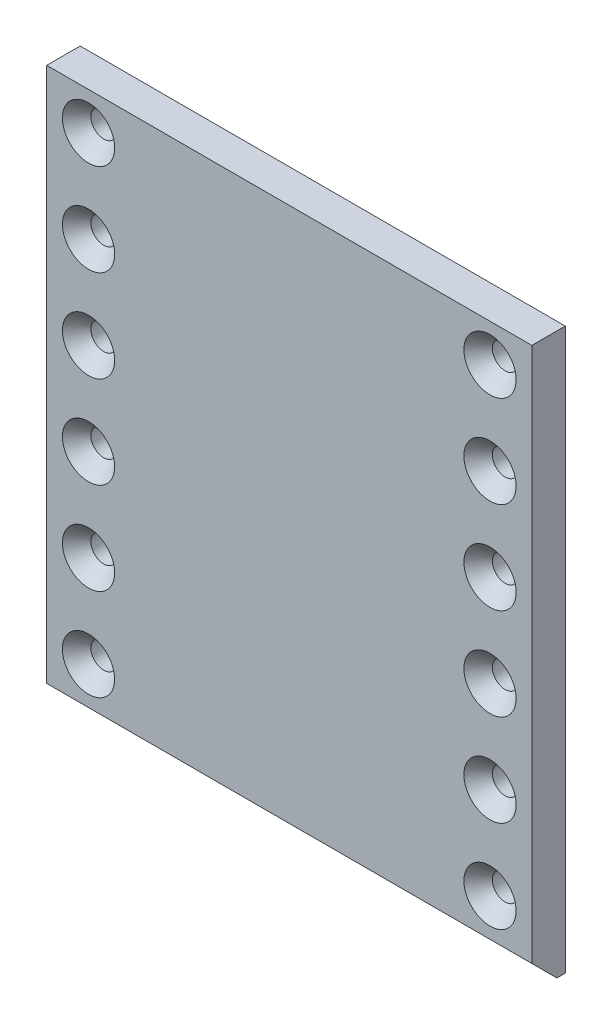
ISO-10303-21;
HEADER;
FILE_DESCRIPTION(('STEP AP214'),'2;1');
FILE_NAME('part.step','',(''),(''),'','','');
FILE_SCHEMA(('AUTOMOTIVE_DESIGN { 1 0 10303 214 1 1 1 1 }'));
ENDSEC;
DATA;
#1=APPLICATION_CONTEXT('core data for automotive mechanical design processes');
#2=APPLICATION_PROTOCOL_DEFINITION('international standard','automotive_design',2000,#1);
#3=PRODUCT_CONTEXT('',#1,'mechanical');
#4=PRODUCT('Part','Part','',(#3));
#5=PRODUCT_RELATED_PRODUCT_CATEGORY('part','',(#4));
#6=PRODUCT_DEFINITION_FORMATION('','',#4);
#7=PRODUCT_DEFINITION_CONTEXT('part definition',#1,'design');
#8=PRODUCT_DEFINITION('design','',#6,#7);
#9=PRODUCT_DEFINITION_SHAPE('','',#8);
#10=(LENGTH_UNIT() NAMED_UNIT(*) SI_UNIT(.MILLI.,.METRE.));
#11=(NAMED_UNIT(*) PLANE_ANGLE_UNIT() SI_UNIT($,.RADIAN.));
#12=(NAMED_UNIT(*) SI_UNIT($,.STERADIAN.) SOLID_ANGLE_UNIT());
#13=UNCERTAINTY_MEASURE_WITH_UNIT(LENGTH_MEASURE(1.E-05),#10,'distance_accuracy_value','');
#14=(GEOMETRIC_REPRESENTATION_CONTEXT(3) GLOBAL_UNCERTAINTY_ASSIGNED_CONTEXT((#13)) GLOBAL_UNIT_ASSIGNED_CONTEXT((#10,
#11,#12)) REPRESENTATION_CONTEXT('',''));
#15=CARTESIAN_POINT('',(0.,0.,0.));
#16=DIRECTION('',(0.,0.,1.));
#17=DIRECTION('',(1.,0.,0.));
#18=AXIS2_PLACEMENT_3D('',#15,#16,#17);
#19=CARTESIAN_POINT('',(92.075,106.3625,6.35));
#20=DIRECTION('',(-1.,0.,0.));
#21=DIRECTION('',(0.,-1.,0.));
#22=AXIS2_PLACEMENT_3D('',#19,#20,#21);
#23=PLANE('',#22);
#24=DIRECTION('',(0.,1.,0.));
#25=VECTOR('',#24,1.);
#26=CARTESIAN_POINT('',(92.075,106.3625,6.35));
#27=LINE('',#26,#25);
#28=CARTESIAN_POINT('',(92.075,-96.8375,6.35000000000001));
#29=VERTEX_POINT('',#28);
#30=CARTESIAN_POINT('',(92.075,106.3625,6.35));
#31=VERTEX_POINT('',#30);
#32=EDGE_CURVE('E76',#29,#31,#27,.T.);
#33=ORIENTED_EDGE('',*,*,#32,.F.);
#34=DIRECTION('',(0.,-0.707106781186547,-0.707106781186549));
#35=VECTOR('',#34,1.);
#36=CARTESIAN_POINT('',(92.075,-96.8375,6.35000000000001));
#37=LINE('',#36,#35);
#38=CARTESIAN_POINT('',(92.075,-106.3625,-3.17500000000006));
#39=VERTEX_POINT('',#38);
#40=EDGE_CURVE('E54',#29,#39,#37,.T.);
#41=ORIENTED_EDGE('',*,*,#40,.T.);
#42=DIRECTION('',(0.,0.,-1.));
#43=VECTOR('',#42,1.);
#44=CARTESIAN_POINT('',(92.075,-106.3625,6.35));
#45=LINE('',#44,#43);
#46=CARTESIAN_POINT('',(92.075,-106.3625,-6.35));
#47=VERTEX_POINT('',#46);
#48=EDGE_CURVE('E106',#39,#47,#45,.T.);
#49=ORIENTED_EDGE('',*,*,#48,.T.);
#50=DIRECTION('',(0.,1.,0.));
#51=VECTOR('',#50,1.);
#52=CARTESIAN_POINT('',(92.075,106.3625,-6.35));
#53=LINE('',#52,#51);
#54=CARTESIAN_POINT('',(92.075,106.3625,-6.35));
#55=VERTEX_POINT('',#54);
#56=EDGE_CURVE('E98',#47,#55,#53,.T.);
#57=ORIENTED_EDGE('',*,*,#56,.T.);
#58=DIRECTION('',(0.,0.,-1.));
#59=VECTOR('',#58,1.);
#60=CARTESIAN_POINT('',(92.075,106.3625,6.35));
#61=LINE('',#60,#59);
#62=EDGE_CURVE('E90',#31,#55,#61,.T.);
#63=ORIENTED_EDGE('',*,*,#62,.F.);
#64=EDGE_LOOP('',(#33,#41,#49,#57,#63));
#65=FACE_BOUND('',#64,.T.);
#66=ADVANCED_FACE('F32',(#65),#23,.F.);
#67=CARTESIAN_POINT('',(-92.075,106.3625,6.35));
#68=DIRECTION('',(0.,-1.,0.));
#69=DIRECTION('',(0.,0.,-1.));
#70=AXIS2_PLACEMENT_3D('',#67,#68,#69);
#71=PLANE('',#70);
#72=DIRECTION('',(-1.,0.,0.));
#73=VECTOR('',#72,1.);
#74=CARTESIAN_POINT('',(-92.075,106.3625,-6.35));
#75=LINE('',#74,#73);
#76=CARTESIAN_POINT('',(-92.075,106.3625,-6.35));
#77=VERTEX_POINT('',#76);
#78=EDGE_CURVE('E113',#55,#77,#75,.T.);
#79=ORIENTED_EDGE('',*,*,#78,.T.);
#80=DIRECTION('',(0.,0.,-1.));
#81=VECTOR('',#80,1.);
#82=CARTESIAN_POINT('',(-92.075,106.3625,6.35));
#83=LINE('',#82,#81);
#84=CARTESIAN_POINT('',(-92.075,106.3625,6.35));
#85=VERTEX_POINT('',#84);
#86=EDGE_CURVE('E93',#85,#77,#83,.T.);
#87=ORIENTED_EDGE('',*,*,#86,.F.);
#88=DIRECTION('',(-1.,0.,0.));
#89=VECTOR('',#88,1.);
#90=CARTESIAN_POINT('',(-92.075,106.3625,6.35));
#91=LINE('',#90,#89);
#92=EDGE_CURVE('E80',#31,#85,#91,.T.);
#93=ORIENTED_EDGE('',*,*,#92,.F.);
#94=ORIENTED_EDGE('',*,*,#62,.T.);
#95=EDGE_LOOP('',(#79,#87,#93,#94));
#96=FACE_BOUND('',#95,.T.);
#97=ADVANCED_FACE('F89',(#96),#71,.F.);
#98=CARTESIAN_POINT('',(-92.075,106.3625,6.35));
#99=DIRECTION('',(1.,0.,0.));
#100=DIRECTION('',(0.,1.,0.));
#101=AXIS2_PLACEMENT_3D('',#98,#99,#100);
#102=PLANE('',#101);
#103=DIRECTION('',(0.,0.,-1.));
#104=VECTOR('',#103,1.);
#105=CARTESIAN_POINT('',(-92.075,-106.3625,6.35));
#106=LINE('',#105,#104);
#107=CARTESIAN_POINT('',(-92.075,-106.3625,-3.17500000000007));
#108=VERTEX_POINT('',#107);
#109=CARTESIAN_POINT('',(-92.075,-106.3625,-6.35));
#110=VERTEX_POINT('',#109);
#111=EDGE_CURVE('E101',#108,#110,#106,.T.);
#112=ORIENTED_EDGE('',*,*,#111,.F.);
#113=DIRECTION('',(0.,0.707106781186547,0.707106781186549));
#114=VECTOR('',#113,1.);
#115=CARTESIAN_POINT('',(-92.075,-96.8375,6.34999999999999));
#116=LINE('',#115,#114);
#117=CARTESIAN_POINT('',(-92.075,-96.8375,6.35));
#118=VERTEX_POINT('',#117);
#119=EDGE_CURVE('E11',#108,#118,#116,.T.);
#120=ORIENTED_EDGE('',*,*,#119,.T.);
#121=DIRECTION('',(0.,-1.,0.));
#122=VECTOR('',#121,1.);
#123=CARTESIAN_POINT('',(-92.075,106.3625,6.35));
#124=LINE('',#123,#122);
#125=EDGE_CURVE('E95',#85,#118,#124,.T.);
#126=ORIENTED_EDGE('',*,*,#125,.F.);
#127=ORIENTED_EDGE('',*,*,#86,.T.);
#128=DIRECTION('',(0.,-1.,0.));
#129=VECTOR('',#128,1.);
#130=CARTESIAN_POINT('',(-92.075,106.3625,-6.35));
#131=LINE('',#130,#129);
#132=EDGE_CURVE('E110',#77,#110,#131,.T.);
#133=ORIENTED_EDGE('',*,*,#132,.T.);
#134=EDGE_LOOP('',(#112,#120,#126,#127,#133));
#135=FACE_BOUND('',#134,.T.);
#136=ADVANCED_FACE('F275',(#135),#102,.F.);
#137=CARTESIAN_POINT('',(-92.075,-106.3625,6.35));
#138=DIRECTION('',(0.,1.,0.));
#139=DIRECTION('',(0.,0.,1.));
#140=AXIS2_PLACEMENT_3D('',#137,#138,#139);
#141=PLANE('',#140);
#142=ORIENTED_EDGE('',*,*,#48,.F.);
#143=DIRECTION('',(-1.,0.,0.));
#144=VECTOR('',#143,1.);
#145=CARTESIAN_POINT('',(-92.075,-106.3625,-3.17500000000006));
#146=LINE('',#145,#144);
#147=EDGE_CURVE('E40',#39,#108,#146,.T.);
#148=ORIENTED_EDGE('',*,*,#147,.T.);
#149=ORIENTED_EDGE('',*,*,#111,.T.);
#150=DIRECTION('',(1.,0.,0.));
#151=VECTOR('',#150,1.);
#152=CARTESIAN_POINT('',(-92.075,-106.3625,-6.35));
#153=LINE('',#152,#151);
#154=EDGE_CURVE('E85',#110,#47,#153,.T.);
#155=ORIENTED_EDGE('',*,*,#154,.T.);
#156=EDGE_LOOP('',(#142,#148,#149,#155));
#157=FACE_BOUND('',#156,.T.);
#158=ADVANCED_FACE('F231',(#157),#141,.F.);
#159=CARTESIAN_POINT('',(0.,0.,6.35));
#160=DIRECTION('',(0.,0.,1.));
#161=DIRECTION('',(1.,0.,0.));
#162=AXIS2_PLACEMENT_3D('',#159,#160,#161);
#163=PLANE('',#162);
#164=CARTESIAN_POINT('',(-76.2,92.075,6.35));
#165=DIRECTION('',(0.,0.,1.));
#166=DIRECTION('',(1.,0.,0.));
#167=AXIS2_PLACEMENT_3D('',#164,#165,#166);
#168=CIRCLE('',#167,9.9187);
#169=CARTESIAN_POINT('',(-66.2813,92.075,6.35));
#170=VERTEX_POINT('',#169);
#171=EDGE_CURVE('E222',#170,#170,#168,.T.);
#172=ORIENTED_EDGE('',*,*,#171,.F.);
#173=EDGE_LOOP('',(#172));
#174=FACE_BOUND('',#173,.T.);
#175=CARTESIAN_POINT('',(-76.2,57.15,6.35));
#176=DIRECTION('',(0.,0.,1.));
#177=DIRECTION('',(1.,0.,0.));
#178=AXIS2_PLACEMENT_3D('',#175,#176,#177);
#179=CIRCLE('',#178,9.9187);
#180=CARTESIAN_POINT('',(-66.2813,57.15,6.35));
#181=VERTEX_POINT('',#180);
#182=EDGE_CURVE('E213',#181,#181,#179,.T.);
#183=ORIENTED_EDGE('',*,*,#182,.F.);
#184=EDGE_LOOP('',(#183));
#185=FACE_BOUND('',#184,.T.);
#186=CARTESIAN_POINT('',(-76.2,22.225,6.35));
#187=DIRECTION('',(0.,0.,1.));
#188=DIRECTION('',(1.,0.,0.));
#189=AXIS2_PLACEMENT_3D('',#186,#187,#188);
#190=CIRCLE('',#189,9.9187);
#191=CARTESIAN_POINT('',(-66.2813,22.225,6.35));
#192=VERTEX_POINT('',#191);
#193=EDGE_CURVE('E204',#192,#192,#190,.T.);
#194=ORIENTED_EDGE('',*,*,#193,.F.);
#195=EDGE_LOOP('',(#194));
#196=FACE_BOUND('',#195,.T.);
#197=CARTESIAN_POINT('',(-76.2,-12.7,6.35));
#198=DIRECTION('',(0.,0.,1.));
#199=DIRECTION('',(1.,0.,0.));
#200=AXIS2_PLACEMENT_3D('',#197,#198,#199);
#201=CIRCLE('',#200,9.9187);
#202=CARTESIAN_POINT('',(-66.2813,-12.7,6.35));
#203=VERTEX_POINT('',#202);
#204=EDGE_CURVE('E195',#203,#203,#201,.T.);
#205=ORIENTED_EDGE('',*,*,#204,.F.);
#206=EDGE_LOOP('',(#205));
#207=FACE_BOUND('',#206,.T.);
#208=CARTESIAN_POINT('',(-76.2,-47.625,6.35));
#209=DIRECTION('',(0.,0.,1.));
#210=DIRECTION('',(1.,0.,0.));
#211=AXIS2_PLACEMENT_3D('',#208,#209,#210);
#212=CIRCLE('',#211,9.9187);
#213=CARTESIAN_POINT('',(-66.2813,-47.625,6.35));
#214=VERTEX_POINT('',#213);
#215=EDGE_CURVE('E186',#214,#214,#212,.T.);
#216=ORIENTED_EDGE('',*,*,#215,.F.);
#217=EDGE_LOOP('',(#216));
#218=FACE_BOUND('',#217,.T.);
#219=CARTESIAN_POINT('',(-76.2,-82.55,6.35));
#220=DIRECTION('',(0.,0.,1.));
#221=DIRECTION('',(1.,0.,0.));
#222=AXIS2_PLACEMENT_3D('',#219,#220,#221);
#223=CIRCLE('',#222,9.9187);
#224=CARTESIAN_POINT('',(-66.2813,-82.55,6.35));
#225=VERTEX_POINT('',#224);
#226=EDGE_CURVE('E177',#225,#225,#223,.T.);
#227=ORIENTED_EDGE('',*,*,#226,.F.);
#228=EDGE_LOOP('',(#227));
#229=FACE_BOUND('',#228,.T.);
#230=CARTESIAN_POINT('',(76.2,-82.55,6.35));
#231=DIRECTION('',(0.,0.,1.));
#232=DIRECTION('',(1.,0.,0.));
#233=AXIS2_PLACEMENT_3D('',#230,#231,#232);
#234=CIRCLE('',#233,9.9187);
#235=CARTESIAN_POINT('',(86.1187,-82.55,6.35));
#236=VERTEX_POINT('',#235);
#237=EDGE_CURVE('E168',#236,#236,#234,.T.);
#238=ORIENTED_EDGE('',*,*,#237,.F.);
#239=EDGE_LOOP('',(#238));
#240=FACE_BOUND('',#239,.T.);
#241=CARTESIAN_POINT('',(76.2,-47.625,6.35));
#242=DIRECTION('',(0.,0.,1.));
#243=DIRECTION('',(1.,0.,0.));
#244=AXIS2_PLACEMENT_3D('',#241,#242,#243);
#245=CIRCLE('',#244,9.9187);
#246=CARTESIAN_POINT('',(86.1187,-47.625,6.35));
#247=VERTEX_POINT('',#246);
#248=EDGE_CURVE('E159',#247,#247,#245,.T.);
#249=ORIENTED_EDGE('',*,*,#248,.F.);
#250=EDGE_LOOP('',(#249));
#251=FACE_BOUND('',#250,.T.);
#252=CARTESIAN_POINT('',(76.2,-12.7,6.35));
#253=DIRECTION('',(0.,0.,1.));
#254=DIRECTION('',(1.,0.,0.));
#255=AXIS2_PLACEMENT_3D('',#252,#253,#254);
#256=CIRCLE('',#255,9.9187);
#257=CARTESIAN_POINT('',(86.1187,-12.7,6.35));
#258=VERTEX_POINT('',#257);
#259=EDGE_CURVE('E150',#258,#258,#256,.T.);
#260=ORIENTED_EDGE('',*,*,#259,.F.);
#261=EDGE_LOOP('',(#260));
#262=FACE_BOUND('',#261,.T.);
#263=CARTESIAN_POINT('',(76.2,22.225,6.35));
#264=DIRECTION('',(0.,0.,1.));
#265=DIRECTION('',(1.,0.,0.));
#266=AXIS2_PLACEMENT_3D('',#263,#264,#265);
#267=CIRCLE('',#266,9.9187);
#268=CARTESIAN_POINT('',(86.1187,22.225,6.35));
#269=VERTEX_POINT('',#268);
#270=EDGE_CURVE('E141',#269,#269,#267,.T.);
#271=ORIENTED_EDGE('',*,*,#270,.F.);
#272=EDGE_LOOP('',(#271));
#273=FACE_BOUND('',#272,.T.);
#274=CARTESIAN_POINT('',(76.2,57.15,6.35));
#275=DIRECTION('',(0.,0.,1.));
#276=DIRECTION('',(1.,0.,0.));
#277=AXIS2_PLACEMENT_3D('',#274,#275,#276);
#278=CIRCLE('',#277,9.9187);
#279=CARTESIAN_POINT('',(86.1187,57.15,6.35));
#280=VERTEX_POINT('',#279);
#281=EDGE_CURVE('E132',#280,#280,#278,.T.);
#282=ORIENTED_EDGE('',*,*,#281,.F.);
#283=EDGE_LOOP('',(#282));
#284=FACE_BOUND('',#283,.T.);
#285=CARTESIAN_POINT('',(76.2,92.075,6.35));
#286=DIRECTION('',(0.,0.,1.));
#287=DIRECTION('',(1.,0.,0.));
#288=AXIS2_PLACEMENT_3D('',#285,#286,#287);
#289=CIRCLE('',#288,9.9187);
#290=CARTESIAN_POINT('',(86.1187,92.075,6.35));
#291=VERTEX_POINT('',#290);
#292=EDGE_CURVE('E123',#291,#291,#289,.T.);
#293=ORIENTED_EDGE('',*,*,#292,.F.);
#294=EDGE_LOOP('',(#293));
#295=FACE_BOUND('',#294,.T.);
#296=ORIENTED_EDGE('',*,*,#125,.T.);
#297=DIRECTION('',(1.,0.,0.));
#298=VECTOR('',#297,1.);
#299=CARTESIAN_POINT('',(92.075,-96.8375,6.35));
#300=LINE('',#299,#298);
#301=EDGE_CURVE('E83',#118,#29,#300,.T.);
#302=ORIENTED_EDGE('',*,*,#301,.T.);
#303=ORIENTED_EDGE('',*,*,#32,.T.);
#304=ORIENTED_EDGE('',*,*,#92,.T.);
#305=EDGE_LOOP('',(#296,#302,#303,#304));
#306=FACE_BOUND('',#305,.T.);
#307=ADVANCED_FACE('F79',(#174,#185,#196,#207,#218,#229,#240,#251,#262,#273,#284,#295,#306),
#163,.T.);
#308=CARTESIAN_POINT('',(0.,0.,-6.35));
#309=DIRECTION('',(0.,0.,1.));
#310=DIRECTION('',(1.,0.,0.));
#311=AXIS2_PLACEMENT_3D('',#308,#309,#310);
#312=PLANE('',#311);
#313=CARTESIAN_POINT('',(-76.2,92.075,-6.35));
#314=DIRECTION('',(0.,0.,1.));
#315=DIRECTION('',(1.,0.,0.));
#316=AXIS2_PLACEMENT_3D('',#313,#314,#315);
#317=CIRCLE('',#316,4.9022);
#318=CARTESIAN_POINT('',(-71.2978,92.075,-6.35));
#319=VERTEX_POINT('',#318);
#320=EDGE_CURVE('E216',#319,#319,#317,.T.);
#321=ORIENTED_EDGE('',*,*,#320,.T.);
#322=EDGE_LOOP('',(#321));
#323=FACE_BOUND('',#322,.T.);
#324=CARTESIAN_POINT('',(-76.2,57.15,-6.35));
#325=DIRECTION('',(0.,0.,1.));
#326=DIRECTION('',(1.,0.,0.));
#327=AXIS2_PLACEMENT_3D('',#324,#325,#326);
#328=CIRCLE('',#327,4.9022);
#329=CARTESIAN_POINT('',(-71.2978,57.15,-6.35));
#330=VERTEX_POINT('',#329);
#331=EDGE_CURVE('E207',#330,#330,#328,.T.);
#332=ORIENTED_EDGE('',*,*,#331,.T.);
#333=EDGE_LOOP('',(#332));
#334=FACE_BOUND('',#333,.T.);
#335=CARTESIAN_POINT('',(-76.2,22.225,-6.35));
#336=DIRECTION('',(0.,0.,1.));
#337=DIRECTION('',(1.,0.,0.));
#338=AXIS2_PLACEMENT_3D('',#335,#336,#337);
#339=CIRCLE('',#338,4.9022);
#340=CARTESIAN_POINT('',(-71.2978,22.225,-6.35));
#341=VERTEX_POINT('',#340);
#342=EDGE_CURVE('E198',#341,#341,#339,.T.);
#343=ORIENTED_EDGE('',*,*,#342,.T.);
#344=EDGE_LOOP('',(#343));
#345=FACE_BOUND('',#344,.T.);
#346=CARTESIAN_POINT('',(-76.2,-12.7,-6.35));
#347=DIRECTION('',(0.,0.,1.));
#348=DIRECTION('',(1.,0.,0.));
#349=AXIS2_PLACEMENT_3D('',#346,#347,#348);
#350=CIRCLE('',#349,4.9022);
#351=CARTESIAN_POINT('',(-71.2978,-12.7,-6.35));
#352=VERTEX_POINT('',#351);
#353=EDGE_CURVE('E189',#352,#352,#350,.T.);
#354=ORIENTED_EDGE('',*,*,#353,.T.);
#355=EDGE_LOOP('',(#354));
#356=FACE_BOUND('',#355,.T.);
#357=CARTESIAN_POINT('',(-76.2,-47.625,-6.35));
#358=DIRECTION('',(0.,0.,1.));
#359=DIRECTION('',(1.,0.,0.));
#360=AXIS2_PLACEMENT_3D('',#357,#358,#359);
#361=CIRCLE('',#360,4.9022);
#362=CARTESIAN_POINT('',(-71.2978,-47.625,-6.35));
#363=VERTEX_POINT('',#362);
#364=EDGE_CURVE('E180',#363,#363,#361,.T.);
#365=ORIENTED_EDGE('',*,*,#364,.T.);
#366=EDGE_LOOP('',(#365));
#367=FACE_BOUND('',#366,.T.);
#368=CARTESIAN_POINT('',(-76.2,-82.55,-6.35));
#369=DIRECTION('',(0.,0.,1.));
#370=DIRECTION('',(1.,0.,0.));
#371=AXIS2_PLACEMENT_3D('',#368,#369,#370);
#372=CIRCLE('',#371,4.9022);
#373=CARTESIAN_POINT('',(-71.2978,-82.55,-6.35));
#374=VERTEX_POINT('',#373);
#375=EDGE_CURVE('E171',#374,#374,#372,.T.);
#376=ORIENTED_EDGE('',*,*,#375,.T.);
#377=EDGE_LOOP('',(#376));
#378=FACE_BOUND('',#377,.T.);
#379=CARTESIAN_POINT('',(76.2,-82.55,-6.35));
#380=DIRECTION('',(0.,0.,1.));
#381=DIRECTION('',(1.,0.,0.));
#382=AXIS2_PLACEMENT_3D('',#379,#380,#381);
#383=CIRCLE('',#382,4.9022);
#384=CARTESIAN_POINT('',(81.1022,-82.55,-6.35));
#385=VERTEX_POINT('',#384);
#386=EDGE_CURVE('E162',#385,#385,#383,.T.);
#387=ORIENTED_EDGE('',*,*,#386,.T.);
#388=EDGE_LOOP('',(#387));
#389=FACE_BOUND('',#388,.T.);
#390=CARTESIAN_POINT('',(76.2,-47.625,-6.35));
#391=DIRECTION('',(0.,0.,1.));
#392=DIRECTION('',(1.,0.,0.));
#393=AXIS2_PLACEMENT_3D('',#390,#391,#392);
#394=CIRCLE('',#393,4.9022);
#395=CARTESIAN_POINT('',(81.1022,-47.625,-6.35));
#396=VERTEX_POINT('',#395);
#397=EDGE_CURVE('E153',#396,#396,#394,.T.);
#398=ORIENTED_EDGE('',*,*,#397,.T.);
#399=EDGE_LOOP('',(#398));
#400=FACE_BOUND('',#399,.T.);
#401=CARTESIAN_POINT('',(76.2,-12.7,-6.35));
#402=DIRECTION('',(0.,0.,1.));
#403=DIRECTION('',(1.,0.,0.));
#404=AXIS2_PLACEMENT_3D('',#401,#402,#403);
#405=CIRCLE('',#404,4.9022);
#406=CARTESIAN_POINT('',(81.1022,-12.7,-6.35));
#407=VERTEX_POINT('',#406);
#408=EDGE_CURVE('E144',#407,#407,#405,.T.);
#409=ORIENTED_EDGE('',*,*,#408,.T.);
#410=EDGE_LOOP('',(#409));
#411=FACE_BOUND('',#410,.T.);
#412=CARTESIAN_POINT('',(76.2,22.225,-6.35));
#413=DIRECTION('',(0.,0.,1.));
#414=DIRECTION('',(1.,0.,0.));
#415=AXIS2_PLACEMENT_3D('',#412,#413,#414);
#416=CIRCLE('',#415,4.9022);
#417=CARTESIAN_POINT('',(81.1022,22.225,-6.35));
#418=VERTEX_POINT('',#417);
#419=EDGE_CURVE('E135',#418,#418,#416,.T.);
#420=ORIENTED_EDGE('',*,*,#419,.T.);
#421=EDGE_LOOP('',(#420));
#422=FACE_BOUND('',#421,.T.);
#423=CARTESIAN_POINT('',(76.2,57.15,-6.35));
#424=DIRECTION('',(0.,0.,1.));
#425=DIRECTION('',(1.,0.,0.));
#426=AXIS2_PLACEMENT_3D('',#423,#424,#425);
#427=CIRCLE('',#426,4.9022);
#428=CARTESIAN_POINT('',(81.1022,57.15,-6.35));
#429=VERTEX_POINT('',#428);
#430=EDGE_CURVE('E126',#429,#429,#427,.T.);
#431=ORIENTED_EDGE('',*,*,#430,.T.);
#432=EDGE_LOOP('',(#431));
#433=FACE_BOUND('',#432,.T.);
#434=CARTESIAN_POINT('',(76.2,92.075,-6.35));
#435=DIRECTION('',(0.,0.,1.));
#436=DIRECTION('',(1.,0.,0.));
#437=AXIS2_PLACEMENT_3D('',#434,#435,#436);
#438=CIRCLE('',#437,4.9022);
#439=CARTESIAN_POINT('',(81.1022,92.075,-6.35));
#440=VERTEX_POINT('',#439);
#441=EDGE_CURVE('E116',#440,#440,#438,.T.);
#442=ORIENTED_EDGE('',*,*,#441,.T.);
#443=EDGE_LOOP('',(#442));
#444=FACE_BOUND('',#443,.T.);
#445=ORIENTED_EDGE('',*,*,#56,.F.);
#446=ORIENTED_EDGE('',*,*,#154,.F.);
#447=ORIENTED_EDGE('',*,*,#132,.F.);
#448=ORIENTED_EDGE('',*,*,#78,.F.);
#449=EDGE_LOOP('',(#445,#446,#447,#448));
#450=FACE_BOUND('',#449,.T.);
#451=ADVANCED_FACE('F230',(#323,#334,#345,#356,#367,#378,#389,#400,#411,#422,#433,#444,#450),
#312,.F.);
#452=CARTESIAN_POINT('',(76.2,92.075,6.35));
#453=DIRECTION('',(0.,0.,1.));
#454=DIRECTION('',(1.,0.,0.));
#455=AXIS2_PLACEMENT_3D('',#452,#453,#454);
#456=CYLINDRICAL_SURFACE('',#455,4.9022);
#457=ORIENTED_EDGE('',*,*,#441,.F.);
#458=EDGE_LOOP('',(#457));
#459=FACE_BOUND('',#458,.T.);
#460=CARTESIAN_POINT('',(76.2,92.075,0.579176885175799));
#461=DIRECTION('',(0.,0.,1.));
#462=DIRECTION('',(1.,0.,0.));
#463=AXIS2_PLACEMENT_3D('',#460,#461,#462);
#464=CIRCLE('',#463,4.9022);
#465=CARTESIAN_POINT('',(81.1022,92.075,0.579176885175799));
#466=VERTEX_POINT('',#465);
#467=EDGE_CURVE('E120',#466,#466,#464,.T.);
#468=ORIENTED_EDGE('',*,*,#467,.T.);
#469=EDGE_LOOP('',(#468));
#470=FACE_BOUND('',#469,.T.);
#471=ADVANCED_FACE('F258',(#459,#470),#456,.F.);
#472=CARTESIAN_POINT('',(76.2,92.075,6.35));
#473=DIRECTION('',(0.,0.,1.));
#474=DIRECTION('',(1.,0.,0.));
#475=AXIS2_PLACEMENT_3D('',#472,#473,#474);
#476=CONICAL_SURFACE('',#475,9.9187,0.715584993317675);
#477=ORIENTED_EDGE('',*,*,#467,.F.);
#478=EDGE_LOOP('',(#477));
#479=FACE_BOUND('',#478,.T.);
#480=ORIENTED_EDGE('',*,*,#292,.T.);
#481=EDGE_LOOP('',(#480));
#482=FACE_BOUND('',#481,.T.);
#483=ADVANCED_FACE('F255',(#479,#482),#476,.F.);
#484=CARTESIAN_POINT('',(76.2,57.15,6.35));
#485=DIRECTION('',(0.,0.,1.));
#486=DIRECTION('',(1.,0.,0.));
#487=AXIS2_PLACEMENT_3D('',#484,#485,#486);
#488=CYLINDRICAL_SURFACE('',#487,4.9022);
#489=ORIENTED_EDGE('',*,*,#430,.F.);
#490=EDGE_LOOP('',(#489));
#491=FACE_BOUND('',#490,.T.);
#492=CARTESIAN_POINT('',(76.2,57.15,0.579176885175799));
#493=DIRECTION('',(0.,0.,1.));
#494=DIRECTION('',(1.,0.,0.));
#495=AXIS2_PLACEMENT_3D('',#492,#493,#494);
#496=CIRCLE('',#495,4.9022);
#497=CARTESIAN_POINT('',(81.1022,57.15,0.579176885175799));
#498=VERTEX_POINT('',#497);
#499=EDGE_CURVE('E129',#498,#498,#496,.T.);
#500=ORIENTED_EDGE('',*,*,#499,.T.);
#501=EDGE_LOOP('',(#500));
#502=FACE_BOUND('',#501,.T.);
#503=ADVANCED_FACE('F257',(#491,#502),#488,.F.);
#504=CARTESIAN_POINT('',(76.2,57.15,6.35));
#505=DIRECTION('',(0.,0.,1.));
#506=DIRECTION('',(1.,0.,0.));
#507=AXIS2_PLACEMENT_3D('',#504,#505,#506);
#508=CONICAL_SURFACE('',#507,9.9187,0.715584993317675);
#509=ORIENTED_EDGE('',*,*,#499,.F.);
#510=EDGE_LOOP('',(#509));
#511=FACE_BOUND('',#510,.T.);
#512=ORIENTED_EDGE('',*,*,#281,.T.);
#513=EDGE_LOOP('',(#512));
#514=FACE_BOUND('',#513,.T.);
#515=ADVANCED_FACE('F265',(#511,#514),#508,.F.);
#516=CARTESIAN_POINT('',(76.2,22.225,6.35));
#517=DIRECTION('',(0.,0.,1.));
#518=DIRECTION('',(1.,0.,0.));
#519=AXIS2_PLACEMENT_3D('',#516,#517,#518);
#520=CYLINDRICAL_SURFACE('',#519,4.9022);
#521=ORIENTED_EDGE('',*,*,#419,.F.);
#522=EDGE_LOOP('',(#521));
#523=FACE_BOUND('',#522,.T.);
#524=CARTESIAN_POINT('',(76.2,22.225,0.579176885175799));
#525=DIRECTION('',(0.,0.,1.));
#526=DIRECTION('',(1.,0.,0.));
#527=AXIS2_PLACEMENT_3D('',#524,#525,#526);
#528=CIRCLE('',#527,4.9022);
#529=CARTESIAN_POINT('',(81.1022,22.225,0.579176885175799));
#530=VERTEX_POINT('',#529);
#531=EDGE_CURVE('E138',#530,#530,#528,.T.);
#532=ORIENTED_EDGE('',*,*,#531,.T.);
#533=EDGE_LOOP('',(#532));
#534=FACE_BOUND('',#533,.T.);
#535=ADVANCED_FACE('F396',(#523,#534),#520,.F.);
#536=CARTESIAN_POINT('',(76.2,22.225,6.35));
#537=DIRECTION('',(0.,0.,1.));
#538=DIRECTION('',(1.,0.,0.));
#539=AXIS2_PLACEMENT_3D('',#536,#537,#538);
#540=CONICAL_SURFACE('',#539,9.9187,0.715584993317675);
#541=ORIENTED_EDGE('',*,*,#531,.F.);
#542=EDGE_LOOP('',(#541));
#543=FACE_BOUND('',#542,.T.);
#544=ORIENTED_EDGE('',*,*,#270,.T.);
#545=EDGE_LOOP('',(#544));
#546=FACE_BOUND('',#545,.T.);
#547=ADVANCED_FACE('F392',(#543,#546),#540,.F.);
#548=CARTESIAN_POINT('',(76.2,-12.7,6.35));
#549=DIRECTION('',(0.,0.,1.));
#550=DIRECTION('',(1.,0.,0.));
#551=AXIS2_PLACEMENT_3D('',#548,#549,#550);
#552=CYLINDRICAL_SURFACE('',#551,4.9022);
#553=ORIENTED_EDGE('',*,*,#408,.F.);
#554=EDGE_LOOP('',(#553));
#555=FACE_BOUND('',#554,.T.);
#556=CARTESIAN_POINT('',(76.2,-12.7,0.579176885175799));
#557=DIRECTION('',(0.,0.,1.));
#558=DIRECTION('',(1.,0.,0.));
#559=AXIS2_PLACEMENT_3D('',#556,#557,#558);
#560=CIRCLE('',#559,4.9022);
#561=CARTESIAN_POINT('',(81.1022,-12.7,0.579176885175799));
#562=VERTEX_POINT('',#561);
#563=EDGE_CURVE('E147',#562,#562,#560,.T.);
#564=ORIENTED_EDGE('',*,*,#563,.T.);
#565=EDGE_LOOP('',(#564));
#566=FACE_BOUND('',#565,.T.);
#567=ADVANCED_FACE('F388',(#555,#566),#552,.F.);
#568=CARTESIAN_POINT('',(76.2,-12.7,6.35));
#569=DIRECTION('',(0.,0.,1.));
#570=DIRECTION('',(1.,0.,0.));
#571=AXIS2_PLACEMENT_3D('',#568,#569,#570);
#572=CONICAL_SURFACE('',#571,9.9187,0.715584993317675);
#573=ORIENTED_EDGE('',*,*,#563,.F.);
#574=EDGE_LOOP('',(#573));
#575=FACE_BOUND('',#574,.T.);
#576=ORIENTED_EDGE('',*,*,#259,.T.);
#577=EDGE_LOOP('',(#576));
#578=FACE_BOUND('',#577,.T.);
#579=ADVANCED_FACE('F384',(#575,#578),#572,.F.);
#580=CARTESIAN_POINT('',(76.2,-47.625,6.35));
#581=DIRECTION('',(0.,0.,1.));
#582=DIRECTION('',(1.,0.,0.));
#583=AXIS2_PLACEMENT_3D('',#580,#581,#582);
#584=CYLINDRICAL_SURFACE('',#583,4.9022);
#585=ORIENTED_EDGE('',*,*,#397,.F.);
#586=EDGE_LOOP('',(#585));
#587=FACE_BOUND('',#586,.T.);
#588=CARTESIAN_POINT('',(76.2,-47.625,0.579176885175799));
#589=DIRECTION('',(0.,0.,1.));
#590=DIRECTION('',(1.,0.,0.));
#591=AXIS2_PLACEMENT_3D('',#588,#589,#590);
#592=CIRCLE('',#591,4.9022);
#593=CARTESIAN_POINT('',(81.1022,-47.625,0.579176885175799));
#594=VERTEX_POINT('',#593);
#595=EDGE_CURVE('E156',#594,#594,#592,.T.);
#596=ORIENTED_EDGE('',*,*,#595,.T.);
#597=EDGE_LOOP('',(#596));
#598=FACE_BOUND('',#597,.T.);
#599=ADVANCED_FACE('F380',(#587,#598),#584,.F.);
#600=CARTESIAN_POINT('',(76.2,-47.625,6.35));
#601=DIRECTION('',(0.,0.,1.));
#602=DIRECTION('',(1.,0.,0.));
#603=AXIS2_PLACEMENT_3D('',#600,#601,#602);
#604=CONICAL_SURFACE('',#603,9.9187,0.715584993317675);
#605=ORIENTED_EDGE('',*,*,#595,.F.);
#606=EDGE_LOOP('',(#605));
#607=FACE_BOUND('',#606,.T.);
#608=ORIENTED_EDGE('',*,*,#248,.T.);
#609=EDGE_LOOP('',(#608));
#610=FACE_BOUND('',#609,.T.);
#611=ADVANCED_FACE('F376',(#607,#610),#604,.F.);
#612=CARTESIAN_POINT('',(76.2,-82.55,6.35));
#613=DIRECTION('',(0.,0.,1.));
#614=DIRECTION('',(1.,0.,0.));
#615=AXIS2_PLACEMENT_3D('',#612,#613,#614);
#616=CYLINDRICAL_SURFACE('',#615,4.9022);
#617=ORIENTED_EDGE('',*,*,#386,.F.);
#618=EDGE_LOOP('',(#617));
#619=FACE_BOUND('',#618,.T.);
#620=CARTESIAN_POINT('',(76.2,-82.55,0.579176885175799));
#621=DIRECTION('',(0.,0.,1.));
#622=DIRECTION('',(1.,0.,0.));
#623=AXIS2_PLACEMENT_3D('',#620,#621,#622);
#624=CIRCLE('',#623,4.9022);
#625=CARTESIAN_POINT('',(81.1022,-82.55,0.579176885175799));
#626=VERTEX_POINT('',#625);
#627=EDGE_CURVE('E165',#626,#626,#624,.T.);
#628=ORIENTED_EDGE('',*,*,#627,.T.);
#629=EDGE_LOOP('',(#628));
#630=FACE_BOUND('',#629,.T.);
#631=ADVANCED_FACE('F372',(#619,#630),#616,.F.);
#632=CARTESIAN_POINT('',(76.2,-82.55,6.35));
#633=DIRECTION('',(0.,0.,1.));
#634=DIRECTION('',(1.,0.,0.));
#635=AXIS2_PLACEMENT_3D('',#632,#633,#634);
#636=CONICAL_SURFACE('',#635,9.9187,0.715584993317675);
#637=ORIENTED_EDGE('',*,*,#627,.F.);
#638=EDGE_LOOP('',(#637));
#639=FACE_BOUND('',#638,.T.);
#640=ORIENTED_EDGE('',*,*,#237,.T.);
#641=EDGE_LOOP('',(#640));
#642=FACE_BOUND('',#641,.T.);
#643=ADVANCED_FACE('F368',(#639,#642),#636,.F.);
#644=CARTESIAN_POINT('',(-76.2,-82.55,6.35));
#645=DIRECTION('',(0.,0.,1.));
#646=DIRECTION('',(1.,0.,0.));
#647=AXIS2_PLACEMENT_3D('',#644,#645,#646);
#648=CYLINDRICAL_SURFACE('',#647,4.9022);
#649=ORIENTED_EDGE('',*,*,#375,.F.);
#650=EDGE_LOOP('',(#649));
#651=FACE_BOUND('',#650,.T.);
#652=CARTESIAN_POINT('',(-76.2,-82.55,0.579176885175799));
#653=DIRECTION('',(0.,0.,1.));
#654=DIRECTION('',(1.,0.,0.));
#655=AXIS2_PLACEMENT_3D('',#652,#653,#654);
#656=CIRCLE('',#655,4.9022);
#657=CARTESIAN_POINT('',(-71.2978,-82.55,0.579176885175799));
#658=VERTEX_POINT('',#657);
#659=EDGE_CURVE('E174',#658,#658,#656,.T.);
#660=ORIENTED_EDGE('',*,*,#659,.T.);
#661=EDGE_LOOP('',(#660));
#662=FACE_BOUND('',#661,.T.);
#663=ADVANCED_FACE('F364',(#651,#662),#648,.F.);
#664=CARTESIAN_POINT('',(-76.2,-82.55,6.35));
#665=DIRECTION('',(0.,0.,1.));
#666=DIRECTION('',(1.,0.,0.));
#667=AXIS2_PLACEMENT_3D('',#664,#665,#666);
#668=CONICAL_SURFACE('',#667,9.9187,0.715584993317675);
#669=ORIENTED_EDGE('',*,*,#659,.F.);
#670=EDGE_LOOP('',(#669));
#671=FACE_BOUND('',#670,.T.);
#672=ORIENTED_EDGE('',*,*,#226,.T.);
#673=EDGE_LOOP('',(#672));
#674=FACE_BOUND('',#673,.T.);
#675=ADVANCED_FACE('F360',(#671,#674),#668,.F.);
#676=CARTESIAN_POINT('',(-76.2,-47.625,6.35));
#677=DIRECTION('',(0.,0.,1.));
#678=DIRECTION('',(1.,0.,0.));
#679=AXIS2_PLACEMENT_3D('',#676,#677,#678);
#680=CYLINDRICAL_SURFACE('',#679,4.9022);
#681=ORIENTED_EDGE('',*,*,#364,.F.);
#682=EDGE_LOOP('',(#681));
#683=FACE_BOUND('',#682,.T.);
#684=CARTESIAN_POINT('',(-76.2,-47.625,0.579176885175799));
#685=DIRECTION('',(0.,0.,1.));
#686=DIRECTION('',(1.,0.,0.));
#687=AXIS2_PLACEMENT_3D('',#684,#685,#686);
#688=CIRCLE('',#687,4.9022);
#689=CARTESIAN_POINT('',(-71.2978,-47.625,0.579176885175799));
#690=VERTEX_POINT('',#689);
#691=EDGE_CURVE('E183',#690,#690,#688,.T.);
#692=ORIENTED_EDGE('',*,*,#691,.T.);
#693=EDGE_LOOP('',(#692));
#694=FACE_BOUND('',#693,.T.);
#695=ADVANCED_FACE('F356',(#683,#694),#680,.F.);
#696=CARTESIAN_POINT('',(-76.2,-47.625,6.35));
#697=DIRECTION('',(0.,0.,1.));
#698=DIRECTION('',(1.,0.,0.));
#699=AXIS2_PLACEMENT_3D('',#696,#697,#698);
#700=CONICAL_SURFACE('',#699,9.9187,0.715584993317675);
#701=ORIENTED_EDGE('',*,*,#691,.F.);
#702=EDGE_LOOP('',(#701));
#703=FACE_BOUND('',#702,.T.);
#704=ORIENTED_EDGE('',*,*,#215,.T.);
#705=EDGE_LOOP('',(#704));
#706=FACE_BOUND('',#705,.T.);
#707=ADVANCED_FACE('F352',(#703,#706),#700,.F.);
#708=CARTESIAN_POINT('',(-76.2,-12.7,6.35));
#709=DIRECTION('',(0.,0.,1.));
#710=DIRECTION('',(1.,0.,0.));
#711=AXIS2_PLACEMENT_3D('',#708,#709,#710);
#712=CYLINDRICAL_SURFACE('',#711,4.9022);
#713=ORIENTED_EDGE('',*,*,#353,.F.);
#714=EDGE_LOOP('',(#713));
#715=FACE_BOUND('',#714,.T.);
#716=CARTESIAN_POINT('',(-76.2,-12.7,0.579176885175799));
#717=DIRECTION('',(0.,0.,1.));
#718=DIRECTION('',(1.,0.,0.));
#719=AXIS2_PLACEMENT_3D('',#716,#717,#718);
#720=CIRCLE('',#719,4.9022);
#721=CARTESIAN_POINT('',(-71.2978,-12.7,0.579176885175799));
#722=VERTEX_POINT('',#721);
#723=EDGE_CURVE('E192',#722,#722,#720,.T.);
#724=ORIENTED_EDGE('',*,*,#723,.T.);
#725=EDGE_LOOP('',(#724));
#726=FACE_BOUND('',#725,.T.);
#727=ADVANCED_FACE('F348',(#715,#726),#712,.F.);
#728=CARTESIAN_POINT('',(-76.2,-12.7,6.35));
#729=DIRECTION('',(0.,0.,1.));
#730=DIRECTION('',(1.,0.,0.));
#731=AXIS2_PLACEMENT_3D('',#728,#729,#730);
#732=CONICAL_SURFACE('',#731,9.9187,0.715584993317675);
#733=ORIENTED_EDGE('',*,*,#723,.F.);
#734=EDGE_LOOP('',(#733));
#735=FACE_BOUND('',#734,.T.);
#736=ORIENTED_EDGE('',*,*,#204,.T.);
#737=EDGE_LOOP('',(#736));
#738=FACE_BOUND('',#737,.T.);
#739=ADVANCED_FACE('F344',(#735,#738),#732,.F.);
#740=CARTESIAN_POINT('',(-76.2,22.225,6.35));
#741=DIRECTION('',(0.,0.,1.));
#742=DIRECTION('',(1.,0.,0.));
#743=AXIS2_PLACEMENT_3D('',#740,#741,#742);
#744=CYLINDRICAL_SURFACE('',#743,4.9022);
#745=ORIENTED_EDGE('',*,*,#342,.F.);
#746=EDGE_LOOP('',(#745));
#747=FACE_BOUND('',#746,.T.);
#748=CARTESIAN_POINT('',(-76.2,22.225,0.579176885175799));
#749=DIRECTION('',(0.,0.,1.));
#750=DIRECTION('',(1.,0.,0.));
#751=AXIS2_PLACEMENT_3D('',#748,#749,#750);
#752=CIRCLE('',#751,4.9022);
#753=CARTESIAN_POINT('',(-71.2978,22.225,0.579176885175799));
#754=VERTEX_POINT('',#753);
#755=EDGE_CURVE('E201',#754,#754,#752,.T.);
#756=ORIENTED_EDGE('',*,*,#755,.T.);
#757=EDGE_LOOP('',(#756));
#758=FACE_BOUND('',#757,.T.);
#759=ADVANCED_FACE('F340',(#747,#758),#744,.F.);
#760=CARTESIAN_POINT('',(-76.2,22.225,6.35));
#761=DIRECTION('',(0.,0.,1.));
#762=DIRECTION('',(1.,0.,0.));
#763=AXIS2_PLACEMENT_3D('',#760,#761,#762);
#764=CONICAL_SURFACE('',#763,9.9187,0.715584993317675);
#765=ORIENTED_EDGE('',*,*,#755,.F.);
#766=EDGE_LOOP('',(#765));
#767=FACE_BOUND('',#766,.T.);
#768=ORIENTED_EDGE('',*,*,#193,.T.);
#769=EDGE_LOOP('',(#768));
#770=FACE_BOUND('',#769,.T.);
#771=ADVANCED_FACE('F336',(#767,#770),#764,.F.);
#772=CARTESIAN_POINT('',(-76.2,57.15,6.35));
#773=DIRECTION('',(0.,0.,1.));
#774=DIRECTION('',(1.,0.,0.));
#775=AXIS2_PLACEMENT_3D('',#772,#773,#774);
#776=CYLINDRICAL_SURFACE('',#775,4.9022);
#777=ORIENTED_EDGE('',*,*,#331,.F.);
#778=EDGE_LOOP('',(#777));
#779=FACE_BOUND('',#778,.T.);
#780=CARTESIAN_POINT('',(-76.2,57.15,0.579176885175799));
#781=DIRECTION('',(0.,0.,1.));
#782=DIRECTION('',(1.,0.,0.));
#783=AXIS2_PLACEMENT_3D('',#780,#781,#782);
#784=CIRCLE('',#783,4.9022);
#785=CARTESIAN_POINT('',(-71.2978,57.15,0.579176885175799));
#786=VERTEX_POINT('',#785);
#787=EDGE_CURVE('E210',#786,#786,#784,.T.);
#788=ORIENTED_EDGE('',*,*,#787,.T.);
#789=EDGE_LOOP('',(#788));
#790=FACE_BOUND('',#789,.T.);
#791=ADVANCED_FACE('F332',(#779,#790),#776,.F.);
#792=CARTESIAN_POINT('',(-76.2,57.15,6.35));
#793=DIRECTION('',(0.,0.,1.));
#794=DIRECTION('',(1.,0.,0.));
#795=AXIS2_PLACEMENT_3D('',#792,#793,#794);
#796=CONICAL_SURFACE('',#795,9.9187,0.715584993317675);
#797=ORIENTED_EDGE('',*,*,#787,.F.);
#798=EDGE_LOOP('',(#797));
#799=FACE_BOUND('',#798,.T.);
#800=ORIENTED_EDGE('',*,*,#182,.T.);
#801=EDGE_LOOP('',(#800));
#802=FACE_BOUND('',#801,.T.);
#803=ADVANCED_FACE('F325',(#799,#802),#796,.F.);
#804=CARTESIAN_POINT('',(-76.2,92.075,6.35));
#805=DIRECTION('',(0.,0.,1.));
#806=DIRECTION('',(1.,0.,0.));
#807=AXIS2_PLACEMENT_3D('',#804,#805,#806);
#808=CYLINDRICAL_SURFACE('',#807,4.9022);
#809=ORIENTED_EDGE('',*,*,#320,.F.);
#810=EDGE_LOOP('',(#809));
#811=FACE_BOUND('',#810,.T.);
#812=CARTESIAN_POINT('',(-76.2,92.075,0.579176885175799));
#813=DIRECTION('',(0.,0.,1.));
#814=DIRECTION('',(1.,0.,0.));
#815=AXIS2_PLACEMENT_3D('',#812,#813,#814);
#816=CIRCLE('',#815,4.9022);
#817=CARTESIAN_POINT('',(-71.2978,92.075,0.579176885175799));
#818=VERTEX_POINT('',#817);
#819=EDGE_CURVE('E219',#818,#818,#816,.T.);
#820=ORIENTED_EDGE('',*,*,#819,.T.);
#821=EDGE_LOOP('',(#820));
#822=FACE_BOUND('',#821,.T.);
#823=ADVANCED_FACE('F319',(#811,#822),#808,.F.);
#824=CARTESIAN_POINT('',(-76.2,92.075,6.35));
#825=DIRECTION('',(0.,0.,1.));
#826=DIRECTION('',(1.,0.,0.));
#827=AXIS2_PLACEMENT_3D('',#824,#825,#826);
#828=CONICAL_SURFACE('',#827,9.9187,0.715584993317675);
#829=ORIENTED_EDGE('',*,*,#819,.F.);
#830=EDGE_LOOP('',(#829));
#831=FACE_BOUND('',#830,.T.);
#832=ORIENTED_EDGE('',*,*,#171,.T.);
#833=EDGE_LOOP('',(#832));
#834=FACE_BOUND('',#833,.T.);
#835=ADVANCED_FACE('F226',(#831,#834),#828,.F.);
#836=CARTESIAN_POINT('',(0.,-96.8375,6.35));
#837=DIRECTION('',(0.,-0.707106781186548,0.707106781186546));
#838=DIRECTION('',(-1.,0.,0.));
#839=AXIS2_PLACEMENT_3D('',#836,#837,#838);
#840=PLANE('',#839);
#841=ORIENTED_EDGE('',*,*,#119,.F.);
#842=ORIENTED_EDGE('',*,*,#147,.F.);
#843=ORIENTED_EDGE('',*,*,#40,.F.);
#844=ORIENTED_EDGE('',*,*,#301,.F.);
#845=EDGE_LOOP('',(#841,#842,#843,#844));
#846=FACE_BOUND('',#845,.T.);
#847=ADVANCED_FACE('F34',(#846),#840,.T.);
#848=CLOSED_SHELL('',(#66,#97,#136,#158,#307,#451,#471,#483,#503,#515,#535,#547,#567,#579,#599,
#611,#631,#643,#663,#675,#695,#707,#727,#739,#759,#771,#791,#803,#823,#835,#847));
#849=MANIFOLD_SOLID_BREP('B2',#848);
#850=ADVANCED_BREP_SHAPE_REPRESENTATION('',(#18,#849),#14);
#851=SHAPE_DEFINITION_REPRESENTATION(#9,#850);
ENDSEC;
END-ISO-10303-21;
